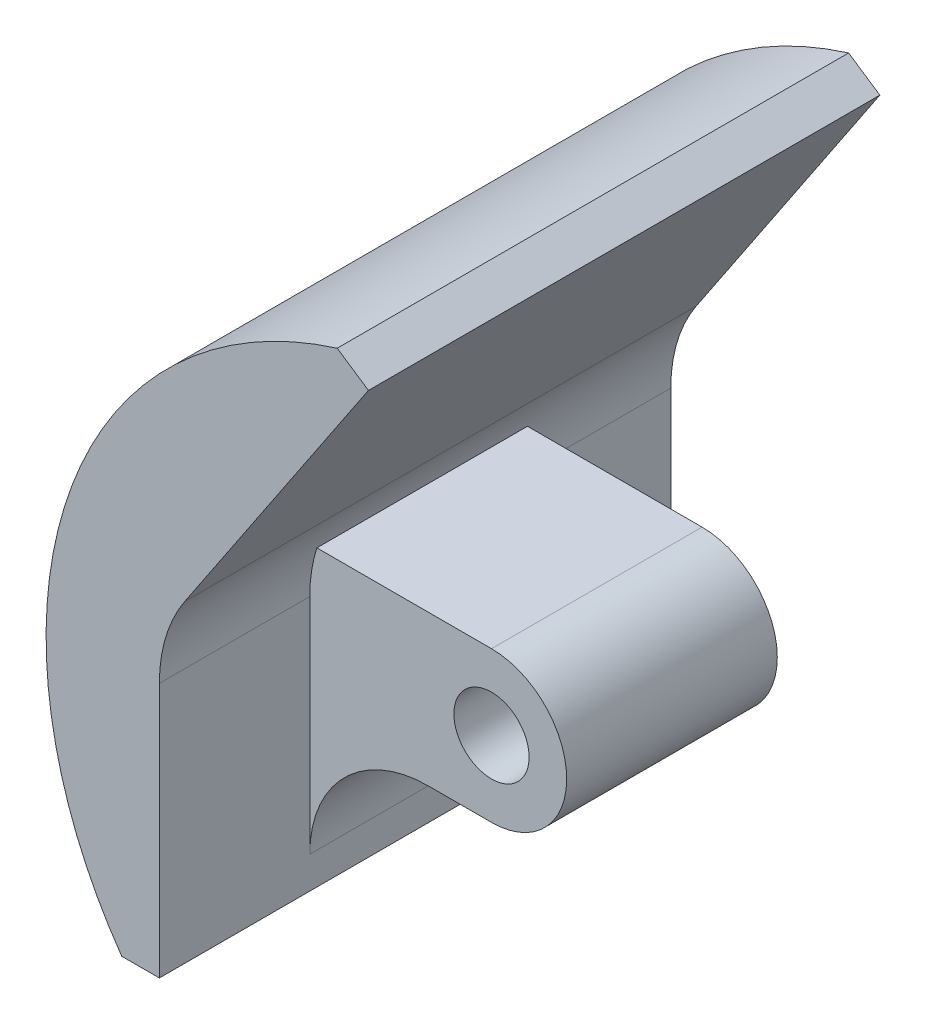
ISO-10303-21;
HEADER;
FILE_DESCRIPTION(('STEP AP214'),'2;1');
FILE_NAME('part.step','',(''),(''),'','','');
FILE_SCHEMA(('AUTOMOTIVE_DESIGN { 1 0 10303 214 1 1 1 1 }'));
ENDSEC;
DATA;
#1=APPLICATION_CONTEXT('core data for automotive mechanical design processes');
#2=APPLICATION_PROTOCOL_DEFINITION('international standard','automotive_design',2000,#1);
#3=PRODUCT_CONTEXT('',#1,'mechanical');
#4=PRODUCT('Part','Part','',(#3));
#5=PRODUCT_RELATED_PRODUCT_CATEGORY('part','',(#4));
#6=PRODUCT_DEFINITION_FORMATION('','',#4);
#7=PRODUCT_DEFINITION_CONTEXT('part definition',#1,'design');
#8=PRODUCT_DEFINITION('design','',#6,#7);
#9=PRODUCT_DEFINITION_SHAPE('','',#8);
#10=(LENGTH_UNIT() NAMED_UNIT(*) SI_UNIT(.MILLI.,.METRE.));
#11=(NAMED_UNIT(*) PLANE_ANGLE_UNIT() SI_UNIT($,.RADIAN.));
#12=(NAMED_UNIT(*) SI_UNIT($,.STERADIAN.) SOLID_ANGLE_UNIT());
#13=UNCERTAINTY_MEASURE_WITH_UNIT(LENGTH_MEASURE(1.E-05),#10,'distance_accuracy_value','');
#14=(GEOMETRIC_REPRESENTATION_CONTEXT(3) GLOBAL_UNCERTAINTY_ASSIGNED_CONTEXT((#13)) GLOBAL_UNIT_ASSIGNED_CONTEXT((#10,
#11,#12)) REPRESENTATION_CONTEXT('',''));
#15=CARTESIAN_POINT('',(0.,0.,0.));
#16=DIRECTION('',(0.,0.,1.));
#17=DIRECTION('',(1.,0.,0.));
#18=AXIS2_PLACEMENT_3D('',#15,#16,#17);
#19=CARTESIAN_POINT('',(-12.7,137.7,17.78));
#20=DIRECTION('',(0.,0.,1.));
#21=DIRECTION('',(1.,0.,0.));
#22=AXIS2_PLACEMENT_3D('',#19,#20,#21);
#23=PLANE('',#22);
#24=CARTESIAN_POINT('',(-12.7,137.7,17.78));
#25=DIRECTION('',(0.,0.,1.));
#26=DIRECTION('',(1.,0.,0.));
#27=AXIS2_PLACEMENT_3D('',#24,#25,#26);
#28=CIRCLE('',#27,3.175);
#29=CARTESIAN_POINT('',(-9.525,137.7,17.78));
#30=VERTEX_POINT('',#29);
#31=EDGE_CURVE('E218',#30,#30,#28,.T.);
#32=ORIENTED_EDGE('',*,*,#31,.F.);
#33=EDGE_LOOP('',(#32));
#34=FACE_BOUND('',#33,.T.);
#35=DIRECTION('',(-1.,0.,0.));
#36=VECTOR('',#35,1.);
#37=CARTESIAN_POINT('',(-12.7,144.05,17.78));
#38=LINE('',#37,#36);
#39=CARTESIAN_POINT('',(-12.7,144.05,17.78));
#40=VERTEX_POINT('',#39);
#41=CARTESIAN_POINT('',(-27.4415251720694,144.05,17.78));
#42=VERTEX_POINT('',#41);
#43=EDGE_CURVE('E197',#40,#42,#38,.T.);
#44=ORIENTED_EDGE('',*,*,#43,.T.);
#45=CARTESIAN_POINT('',(-15.3411167192963,140.193821156111,17.78));
#46=DIRECTION('',(0.,0.,1.));
#47=DIRECTION('',(1.,0.,0.));
#48=AXIS2_PLACEMENT_3D('',#45,#46,#47);
#49=CIRCLE('',#48,12.7);
#50=CARTESIAN_POINT('',(-28.0411167192963,140.193821156111,17.78));
#51=VERTEX_POINT('',#50);
#52=EDGE_CURVE('E194',#42,#51,#49,.T.);
#53=ORIENTED_EDGE('',*,*,#52,.T.);
#54=DIRECTION('',(0.,-1.,0.));
#55=VECTOR('',#54,1.);
#56=CARTESIAN_POINT('',(-28.0411167192963,144.05,17.78));
#57=LINE('',#56,#55);
#58=CARTESIAN_POINT('',(-28.0411167192963,121.35,17.78));
#59=VERTEX_POINT('',#58);
#60=EDGE_CURVE('E209',#51,#59,#57,.T.);
#61=ORIENTED_EDGE('',*,*,#60,.T.);
#62=CARTESIAN_POINT('',(-18.0411167192963,121.35,17.78));
#63=DIRECTION('',(0.,0.,1.));
#64=DIRECTION('',(1.,0.,0.));
#65=AXIS2_PLACEMENT_3D('',#62,#63,#64);
#66=CIRCLE('',#65,10.);
#67=CARTESIAN_POINT('',(-18.0411167192963,131.35,17.78));
#68=VERTEX_POINT('',#67);
#69=EDGE_CURVE('E51',#59,#68,#66,.F.);
#70=ORIENTED_EDGE('',*,*,#69,.T.);
#71=DIRECTION('',(1.,0.,0.));
#72=VECTOR('',#71,1.);
#73=CARTESIAN_POINT('',(-12.7,131.35,17.78));
#74=LINE('',#73,#72);
#75=CARTESIAN_POINT('',(-12.7,131.35,17.78));
#76=VERTEX_POINT('',#75);
#77=EDGE_CURVE('E202',#68,#76,#74,.T.);
#78=ORIENTED_EDGE('',*,*,#77,.T.);
#79=CARTESIAN_POINT('',(-12.7,137.7,17.78));
#80=DIRECTION('',(0.,0.,1.));
#81=DIRECTION('',(1.,0.,0.));
#82=AXIS2_PLACEMENT_3D('',#79,#80,#81);
#83=CIRCLE('',#82,6.34999999999999);
#84=EDGE_CURVE('E224',#76,#40,#83,.T.);
#85=ORIENTED_EDGE('',*,*,#84,.T.);
#86=EDGE_LOOP('',(#44,#53,#61,#70,#78,#85));
#87=FACE_BOUND('',#86,.T.);
#88=ADVANCED_FACE('F43',(#34,#87),#23,.T.);
#89=CARTESIAN_POINT('',(-12.7,137.7,0.));
#90=DIRECTION('',(0.,0.,1.));
#91=DIRECTION('',(1.,0.,0.));
#92=AXIS2_PLACEMENT_3D('',#89,#90,#91);
#93=PLANE('',#92);
#94=CARTESIAN_POINT('',(-12.7,137.7,0.));
#95=DIRECTION('',(0.,0.,1.));
#96=DIRECTION('',(1.,0.,0.));
#97=AXIS2_PLACEMENT_3D('',#94,#95,#96);
#98=CIRCLE('',#97,3.175);
#99=CARTESIAN_POINT('',(-9.525,137.7,0.));
#100=VERTEX_POINT('',#99);
#101=EDGE_CURVE('E215',#100,#100,#98,.T.);
#102=ORIENTED_EDGE('',*,*,#101,.T.);
#103=EDGE_LOOP('',(#102));
#104=FACE_BOUND('',#103,.T.);
#105=CARTESIAN_POINT('',(-15.3411167192963,140.193821156111,0.));
#106=DIRECTION('',(0.,0.,1.));
#107=DIRECTION('',(1.,0.,0.));
#108=AXIS2_PLACEMENT_3D('',#105,#106,#107);
#109=CIRCLE('',#108,12.7);
#110=CARTESIAN_POINT('',(-27.4415251720694,144.05,0.));
#111=VERTEX_POINT('',#110);
#112=CARTESIAN_POINT('',(-28.0411167192963,140.193821156111,0.));
#113=VERTEX_POINT('',#112);
#114=EDGE_CURVE('E140',#111,#113,#109,.T.);
#115=ORIENTED_EDGE('',*,*,#114,.F.);
#116=DIRECTION('',(-1.,0.,0.));
#117=VECTOR('',#116,1.);
#118=CARTESIAN_POINT('',(-12.7,144.05,0.));
#119=LINE('',#118,#117);
#120=CARTESIAN_POINT('',(-12.7,144.05,0.));
#121=VERTEX_POINT('',#120);
#122=EDGE_CURVE('E198',#121,#111,#119,.T.);
#123=ORIENTED_EDGE('',*,*,#122,.F.);
#124=CARTESIAN_POINT('',(-12.7,137.7,0.));
#125=DIRECTION('',(0.,0.,1.));
#126=DIRECTION('',(1.,0.,0.));
#127=AXIS2_PLACEMENT_3D('',#124,#125,#126);
#128=CIRCLE('',#127,6.34999999999999);
#129=CARTESIAN_POINT('',(-12.7,131.35,0.));
#130=VERTEX_POINT('',#129);
#131=EDGE_CURVE('E221',#130,#121,#128,.T.);
#132=ORIENTED_EDGE('',*,*,#131,.F.);
#133=DIRECTION('',(1.,0.,0.));
#134=VECTOR('',#133,1.);
#135=CARTESIAN_POINT('',(-12.7,131.35,0.));
#136=LINE('',#135,#134);
#137=CARTESIAN_POINT('',(-18.0411167192963,131.35,0.));
#138=VERTEX_POINT('',#137);
#139=EDGE_CURVE('E204',#138,#130,#136,.T.);
#140=ORIENTED_EDGE('',*,*,#139,.F.);
#141=CARTESIAN_POINT('',(-18.0411167192963,121.35,0.));
#142=DIRECTION('',(0.,0.,1.));
#143=DIRECTION('',(1.,0.,0.));
#144=AXIS2_PLACEMENT_3D('',#141,#142,#143);
#145=CIRCLE('',#144,10.);
#146=CARTESIAN_POINT('',(-28.0411167192963,121.35,0.));
#147=VERTEX_POINT('',#146);
#148=EDGE_CURVE('E12',#138,#147,#145,.T.);
#149=ORIENTED_EDGE('',*,*,#148,.T.);
#150=DIRECTION('',(0.,-1.,0.));
#151=VECTOR('',#150,1.);
#152=CARTESIAN_POINT('',(-28.0411167192963,144.05,0.));
#153=LINE('',#152,#151);
#154=EDGE_CURVE('E201',#113,#147,#153,.T.);
#155=ORIENTED_EDGE('',*,*,#154,.F.);
#156=EDGE_LOOP('',(#115,#123,#132,#140,#149,#155));
#157=FACE_BOUND('',#156,.T.);
#158=ADVANCED_FACE('F240',(#104,#157),#93,.F.);
#159=CARTESIAN_POINT('',(-12.7,144.05,0.));
#160=DIRECTION('',(0.,1.,0.));
#161=DIRECTION('',(0.,0.,1.));
#162=AXIS2_PLACEMENT_3D('',#159,#160,#161);
#163=PLANE('',#162);
#164=ORIENTED_EDGE('',*,*,#122,.T.);
#165=DIRECTION('',(0.,0.,1.));
#166=VECTOR('',#165,1.);
#167=CARTESIAN_POINT('',(-27.4415251720694,144.05,-12.7));
#168=LINE('',#167,#166);
#169=EDGE_CURVE('E227',#111,#42,#168,.T.);
#170=ORIENTED_EDGE('',*,*,#169,.T.);
#171=ORIENTED_EDGE('',*,*,#43,.F.);
#172=DIRECTION('',(0.,0.,1.));
#173=VECTOR('',#172,1.);
#174=CARTESIAN_POINT('',(-12.7,144.05,0.));
#175=LINE('',#174,#173);
#176=EDGE_CURVE('E206',#121,#40,#175,.T.);
#177=ORIENTED_EDGE('',*,*,#176,.F.);
#178=EDGE_LOOP('',(#164,#170,#171,#177));
#179=FACE_BOUND('',#178,.T.);
#180=ADVANCED_FACE('F249',(#179),#163,.T.);
#181=CARTESIAN_POINT('',(-12.7,137.7,17.78));
#182=DIRECTION('',(0.,0.,-1.));
#183=DIRECTION('',(-1.,0.,0.));
#184=AXIS2_PLACEMENT_3D('',#181,#182,#183);
#185=CYLINDRICAL_SURFACE('',#184,6.34999999999999);
#186=ORIENTED_EDGE('',*,*,#84,.F.);
#187=DIRECTION('',(0.,0.,1.));
#188=VECTOR('',#187,1.);
#189=CARTESIAN_POINT('',(-12.7,131.35,0.));
#190=LINE('',#189,#188);
#191=EDGE_CURVE('E212',#130,#76,#190,.T.);
#192=ORIENTED_EDGE('',*,*,#191,.F.);
#193=ORIENTED_EDGE('',*,*,#131,.T.);
#194=ORIENTED_EDGE('',*,*,#176,.T.);
#195=EDGE_LOOP('',(#186,#192,#193,#194));
#196=FACE_BOUND('',#195,.T.);
#197=ADVANCED_FACE('F247',(#196),#185,.T.);
#198=CARTESIAN_POINT('',(-12.7,137.7,17.78));
#199=DIRECTION('',(0.,0.,-1.));
#200=DIRECTION('',(-1.,0.,0.));
#201=AXIS2_PLACEMENT_3D('',#198,#199,#200);
#202=CYLINDRICAL_SURFACE('',#201,3.175);
#203=ORIENTED_EDGE('',*,*,#31,.T.);
#204=EDGE_LOOP('',(#203));
#205=FACE_BOUND('',#204,.T.);
#206=ORIENTED_EDGE('',*,*,#101,.F.);
#207=EDGE_LOOP('',(#206));
#208=FACE_BOUND('',#207,.T.);
#209=ADVANCED_FACE('F285',(#205,#208),#202,.F.);
#210=CARTESIAN_POINT('',(-12.7,131.35,0.));
#211=DIRECTION('',(0.,-1.,0.));
#212=DIRECTION('',(0.,0.,-1.));
#213=AXIS2_PLACEMENT_3D('',#210,#211,#212);
#214=PLANE('',#213);
#215=ORIENTED_EDGE('',*,*,#77,.F.);
#216=DIRECTION('',(0.,0.,1.));
#217=VECTOR('',#216,1.);
#218=CARTESIAN_POINT('',(-18.0411167192963,131.35,0.));
#219=LINE('',#218,#217);
#220=EDGE_CURVE('E58',#68,#138,#219,.F.);
#221=ORIENTED_EDGE('',*,*,#220,.T.);
#222=ORIENTED_EDGE('',*,*,#139,.T.);
#223=ORIENTED_EDGE('',*,*,#191,.T.);
#224=EDGE_LOOP('',(#215,#221,#222,#223));
#225=FACE_BOUND('',#224,.T.);
#226=ADVANCED_FACE('F244',(#225),#214,.T.);
#227=CARTESIAN_POINT('',(-28.0411167192963,118.65,-12.7));
#228=DIRECTION('',(0.,1.,0.));
#229=DIRECTION('',(-1.,0.,0.));
#230=AXIS2_PLACEMENT_3D('',#227,#228,#229);
#231=PLANE('',#230);
#232=DIRECTION('',(0.,0.,1.));
#233=VECTOR('',#232,1.);
#234=CARTESIAN_POINT('',(-28.0411167192963,118.65,-12.7));
#235=LINE('',#234,#233);
#236=CARTESIAN_POINT('',(-28.0411167192963,118.65,-12.7));
#237=VERTEX_POINT('',#236);
#238=CARTESIAN_POINT('',(-28.0411167192963,118.65,30.48));
#239=VERTEX_POINT('',#238);
#240=EDGE_CURVE('E131',#237,#239,#235,.T.);
#241=ORIENTED_EDGE('',*,*,#240,.T.);
#242=DIRECTION('',(-1.,0.,0.));
#243=VECTOR('',#242,1.);
#244=CARTESIAN_POINT('',(-28.0411167192963,118.65,30.48));
#245=LINE('',#244,#243);
#246=CARTESIAN_POINT('',(-31.2161167192963,118.65,30.48));
#247=VERTEX_POINT('',#246);
#248=EDGE_CURVE('E135',#239,#247,#245,.T.);
#249=ORIENTED_EDGE('',*,*,#248,.T.);
#250=DIRECTION('',(0.,0.,1.));
#251=VECTOR('',#250,1.);
#252=CARTESIAN_POINT('',(-31.2161167192963,118.65,-12.7));
#253=LINE('',#252,#251);
#254=CARTESIAN_POINT('',(-31.2161167192963,118.65,-12.7));
#255=VERTEX_POINT('',#254);
#256=EDGE_CURVE('E141',#255,#247,#253,.T.);
#257=ORIENTED_EDGE('',*,*,#256,.F.);
#258=DIRECTION('',(-1.,0.,0.));
#259=VECTOR('',#258,1.);
#260=CARTESIAN_POINT('',(-28.0411167192963,118.65,-12.7));
#261=LINE('',#260,#259);
#262=EDGE_CURVE('E136',#237,#255,#261,.T.);
#263=ORIENTED_EDGE('',*,*,#262,.F.);
#264=EDGE_LOOP('',(#241,#249,#257,#263));
#265=FACE_BOUND('',#264,.T.);
#266=ADVANCED_FACE('F133',(#265),#231,.F.);
#267=CARTESIAN_POINT('',(-2.62128001430255,138.804575629245,-12.7));
#268=DIRECTION('',(0.,0.,1.));
#269=DIRECTION('',(1.,0.,0.));
#270=AXIS2_PLACEMENT_3D('',#267,#268,#269);
#271=CYLINDRICAL_SURFACE('',#270,34.9838763572622);
#272=ORIENTED_EDGE('',*,*,#256,.T.);
#273=CARTESIAN_POINT('',(-2.62128001430255,138.804575629245,30.48));
#274=DIRECTION('',(0.,0.,1.));
#275=DIRECTION('',(1.,0.,0.));
#276=AXIS2_PLACEMENT_3D('',#273,#274,#275);
#277=CIRCLE('',#276,34.9838763572622);
#278=CARTESIAN_POINT('',(-13.026751574775,172.20514099249,30.48));
#279=VERTEX_POINT('',#278);
#280=EDGE_CURVE('E152',#279,#247,#277,.T.);
#281=ORIENTED_EDGE('',*,*,#280,.F.);
#282=DIRECTION('',(0.,0.,1.));
#283=VECTOR('',#282,1.);
#284=CARTESIAN_POINT('',(-13.026751574775,172.20514099249,-12.7));
#285=LINE('',#284,#283);
#286=CARTESIAN_POINT('',(-13.026751574775,172.20514099249,-12.7));
#287=VERTEX_POINT('',#286);
#288=EDGE_CURVE('E190',#287,#279,#285,.T.);
#289=ORIENTED_EDGE('',*,*,#288,.F.);
#290=CARTESIAN_POINT('',(-2.62128001430255,138.804575629245,-12.7));
#291=DIRECTION('',(0.,0.,1.));
#292=DIRECTION('',(1.,0.,0.));
#293=AXIS2_PLACEMENT_3D('',#290,#291,#292);
#294=CIRCLE('',#293,34.9838763572622);
#295=EDGE_CURVE('E171',#287,#255,#294,.T.);
#296=ORIENTED_EDGE('',*,*,#295,.T.);
#297=EDGE_LOOP('',(#272,#281,#289,#296));
#298=FACE_BOUND('',#297,.T.);
#299=ADVANCED_FACE('F262',(#298),#271,.T.);
#300=CARTESIAN_POINT('',(-10.3877709333851,170.439806413899,-12.7));
#301=DIRECTION('',(0.556010890894838,0.831175005162167,0.));
#302=DIRECTION('',(-0.831175005162167,0.556010890894838,0.));
#303=AXIS2_PLACEMENT_3D('',#300,#301,#302);
#304=PLANE('',#303);
#305=ORIENTED_EDGE('',*,*,#288,.T.);
#306=DIRECTION('',(-0.831175005162167,0.556010890894838,0.));
#307=VECTOR('',#306,1.);
#308=CARTESIAN_POINT('',(-10.3877709333851,170.439806413899,30.48));
#309=LINE('',#308,#307);
#310=CARTESIAN_POINT('',(-10.3877709333851,170.439806413899,30.48));
#311=VERTEX_POINT('',#310);
#312=EDGE_CURVE('E161',#311,#279,#309,.T.);
#313=ORIENTED_EDGE('',*,*,#312,.F.);
#314=DIRECTION('',(0.,0.,1.));
#315=VECTOR('',#314,1.);
#316=CARTESIAN_POINT('',(-10.3877709333851,170.439806413899,-12.7));
#317=LINE('',#316,#315);
#318=CARTESIAN_POINT('',(-10.3877709333851,170.439806413899,-12.7));
#319=VERTEX_POINT('',#318);
#320=EDGE_CURVE('E188',#319,#311,#317,.T.);
#321=ORIENTED_EDGE('',*,*,#320,.F.);
#322=DIRECTION('',(-0.831175005162167,0.556010890894838,0.));
#323=VECTOR('',#322,1.);
#324=CARTESIAN_POINT('',(-10.3877709333851,170.439806413899,-12.7));
#325=LINE('',#324,#323);
#326=EDGE_CURVE('E174',#319,#287,#325,.T.);
#327=ORIENTED_EDGE('',*,*,#326,.T.);
#328=EDGE_LOOP('',(#305,#313,#321,#327));
#329=FACE_BOUND('',#328,.T.);
#330=ADVANCED_FACE('F258',(#329),#304,.T.);
#331=CARTESIAN_POINT('',(-25.8970392848558,147.255159470475,-12.7));
#332=DIRECTION('',(0.831175005162166,-0.556010890894839,0.));
#333=DIRECTION('',(0.556010890894839,0.831175005162166,0.));
#334=AXIS2_PLACEMENT_3D('',#331,#332,#333);
#335=PLANE('',#334);
#336=ORIENTED_EDGE('',*,*,#320,.T.);
#337=DIRECTION('',(0.556010890894839,0.831175005162166,0.));
#338=VECTOR('',#337,1.);
#339=CARTESIAN_POINT('',(-25.8970392848558,147.255159470475,30.48));
#340=LINE('',#339,#338);
#341=CARTESIAN_POINT('',(-25.8970392848558,147.255159470475,30.48));
#342=VERTEX_POINT('',#341);
#343=EDGE_CURVE('E163',#342,#311,#340,.T.);
#344=ORIENTED_EDGE('',*,*,#343,.F.);
#345=DIRECTION('',(0.,0.,1.));
#346=VECTOR('',#345,1.);
#347=CARTESIAN_POINT('',(-25.8970392848558,147.255159470475,-12.7));
#348=LINE('',#347,#346);
#349=CARTESIAN_POINT('',(-25.8970392848558,147.255159470475,-12.7));
#350=VERTEX_POINT('',#349);
#351=EDGE_CURVE('E186',#350,#342,#348,.T.);
#352=ORIENTED_EDGE('',*,*,#351,.F.);
#353=DIRECTION('',(0.556010890894839,0.831175005162166,0.));
#354=VECTOR('',#353,1.);
#355=CARTESIAN_POINT('',(-25.8970392848558,147.255159470475,-12.7));
#356=LINE('',#355,#354);
#357=EDGE_CURVE('E177',#350,#319,#356,.T.);
#358=ORIENTED_EDGE('',*,*,#357,.T.);
#359=EDGE_LOOP('',(#336,#344,#352,#358));
#360=FACE_BOUND('',#359,.T.);
#361=ADVANCED_FACE('F266',(#360),#335,.T.);
#362=CARTESIAN_POINT('',(-15.3411167192963,140.193821156111,-12.7));
#363=DIRECTION('',(0.,0.,1.));
#364=DIRECTION('',(1.,0.,0.));
#365=AXIS2_PLACEMENT_3D('',#362,#363,#364);
#366=CYLINDRICAL_SURFACE('',#365,12.7);
#367=ORIENTED_EDGE('',*,*,#52,.F.);
#368=ORIENTED_EDGE('',*,*,#169,.F.);
#369=ORIENTED_EDGE('',*,*,#114,.T.);
#370=DIRECTION('',(0.,0.,1.));
#371=VECTOR('',#370,1.);
#372=CARTESIAN_POINT('',(-28.0411167192963,140.193821156111,-12.7));
#373=LINE('',#372,#371);
#374=CARTESIAN_POINT('',(-28.0411167192963,140.193821156111,-12.7));
#375=VERTEX_POINT('',#374);
#376=EDGE_CURVE('E183',#375,#113,#373,.T.);
#377=ORIENTED_EDGE('',*,*,#376,.F.);
#378=CARTESIAN_POINT('',(-15.3411167192963,140.193821156111,-12.7));
#379=DIRECTION('',(0.,0.,1.));
#380=DIRECTION('',(1.,0.,0.));
#381=AXIS2_PLACEMENT_3D('',#378,#379,#380);
#382=CIRCLE('',#381,12.7);
#383=EDGE_CURVE('E180',#350,#375,#382,.T.);
#384=ORIENTED_EDGE('',*,*,#383,.F.);
#385=ORIENTED_EDGE('',*,*,#351,.T.);
#386=CARTESIAN_POINT('',(-15.3411167192963,140.193821156111,30.48));
#387=DIRECTION('',(0.,0.,1.));
#388=DIRECTION('',(1.,0.,0.));
#389=AXIS2_PLACEMENT_3D('',#386,#387,#388);
#390=CIRCLE('',#389,12.7);
#391=CARTESIAN_POINT('',(-28.0411167192963,140.193821156111,30.48));
#392=VERTEX_POINT('',#391);
#393=EDGE_CURVE('E166',#342,#392,#390,.T.);
#394=ORIENTED_EDGE('',*,*,#393,.T.);
#395=EDGE_CURVE('E157',#51,#392,#373,.T.);
#396=ORIENTED_EDGE('',*,*,#395,.F.);
#397=EDGE_LOOP('',(#367,#368,#369,#377,#384,#385,#394,#396));
#398=FACE_BOUND('',#397,.T.);
#399=ADVANCED_FACE('F251',(#398),#366,.F.);
#400=CARTESIAN_POINT('',(-28.0411167192963,131.35,-12.7));
#401=DIRECTION('',(1.,0.,0.));
#402=DIRECTION('',(0.,0.,-1.));
#403=AXIS2_PLACEMENT_3D('',#400,#401,#402);
#404=PLANE('',#403);
#405=DIRECTION('',(0.,0.,1.));
#406=VECTOR('',#405,1.);
#407=CARTESIAN_POINT('',(-28.0411167192963,121.35,17.78));
#408=LINE('',#407,#406);
#409=EDGE_CURVE('E232',#147,#59,#408,.T.);
#410=ORIENTED_EDGE('',*,*,#409,.T.);
#411=ORIENTED_EDGE('',*,*,#60,.F.);
#412=ORIENTED_EDGE('',*,*,#395,.T.);
#413=DIRECTION('',(0.,-1.,0.));
#414=VECTOR('',#413,1.);
#415=CARTESIAN_POINT('',(-28.0411167192963,131.35,30.48));
#416=LINE('',#415,#414);
#417=EDGE_CURVE('E148',#392,#239,#416,.T.);
#418=ORIENTED_EDGE('',*,*,#417,.T.);
#419=ORIENTED_EDGE('',*,*,#240,.F.);
#420=DIRECTION('',(0.,-1.,0.));
#421=VECTOR('',#420,1.);
#422=CARTESIAN_POINT('',(-28.0411167192963,131.35,-12.7));
#423=LINE('',#422,#421);
#424=EDGE_CURVE('E168',#375,#237,#423,.T.);
#425=ORIENTED_EDGE('',*,*,#424,.F.);
#426=ORIENTED_EDGE('',*,*,#376,.T.);
#427=ORIENTED_EDGE('',*,*,#154,.T.);
#428=EDGE_LOOP('',(#410,#411,#412,#418,#419,#425,#426,#427));
#429=FACE_BOUND('',#428,.T.);
#430=ADVANCED_FACE('F155',(#429),#404,.T.);
#431=CARTESIAN_POINT('',(-2.62128001430255,138.804575629245,-12.7));
#432=DIRECTION('',(0.,0.,1.));
#433=DIRECTION('',(1.,0.,0.));
#434=AXIS2_PLACEMENT_3D('',#431,#432,#433);
#435=PLANE('',#434);
#436=ORIENTED_EDGE('',*,*,#424,.T.);
#437=ORIENTED_EDGE('',*,*,#262,.T.);
#438=ORIENTED_EDGE('',*,*,#295,.F.);
#439=ORIENTED_EDGE('',*,*,#326,.F.);
#440=ORIENTED_EDGE('',*,*,#357,.F.);
#441=ORIENTED_EDGE('',*,*,#383,.T.);
#442=EDGE_LOOP('',(#436,#437,#438,#439,#440,#441));
#443=FACE_BOUND('',#442,.T.);
#444=ADVANCED_FACE('F264',(#443),#435,.F.);
#445=CARTESIAN_POINT('',(-2.62128001430255,138.804575629245,30.48));
#446=DIRECTION('',(0.,0.,1.));
#447=DIRECTION('',(1.,0.,0.));
#448=AXIS2_PLACEMENT_3D('',#445,#446,#447);
#449=PLANE('',#448);
#450=ORIENTED_EDGE('',*,*,#417,.F.);
#451=ORIENTED_EDGE('',*,*,#393,.F.);
#452=ORIENTED_EDGE('',*,*,#343,.T.);
#453=ORIENTED_EDGE('',*,*,#312,.T.);
#454=ORIENTED_EDGE('',*,*,#280,.T.);
#455=ORIENTED_EDGE('',*,*,#248,.F.);
#456=EDGE_LOOP('',(#450,#451,#452,#453,#454,#455));
#457=FACE_BOUND('',#456,.T.);
#458=ADVANCED_FACE('F146',(#457),#449,.T.);
#459=CARTESIAN_POINT('',(-18.0411167192963,121.35,-12.7));
#460=DIRECTION('',(0.,0.,-1.));
#461=DIRECTION('',(-1.,0.,0.));
#462=AXIS2_PLACEMENT_3D('',#459,#460,#461);
#463=CYLINDRICAL_SURFACE('',#462,10.);
#464=ORIENTED_EDGE('',*,*,#148,.F.);
#465=ORIENTED_EDGE('',*,*,#220,.F.);
#466=ORIENTED_EDGE('',*,*,#69,.F.);
#467=ORIENTED_EDGE('',*,*,#409,.F.);
#468=EDGE_LOOP('',(#464,#465,#466,#467));
#469=FACE_BOUND('',#468,.T.);
#470=ADVANCED_FACE('F45',(#469),#463,.F.);
#471=CLOSED_SHELL('',(#88,#158,#180,#197,#209,#226,#266,#299,#330,#361,#399,#430,#444,#458,#470));
#472=MANIFOLD_SOLID_BREP('B2',#471);
#473=ADVANCED_BREP_SHAPE_REPRESENTATION('',(#18,#472),#14);
#474=SHAPE_DEFINITION_REPRESENTATION(#9,#473);
ENDSEC;
END-ISO-10303-21;
